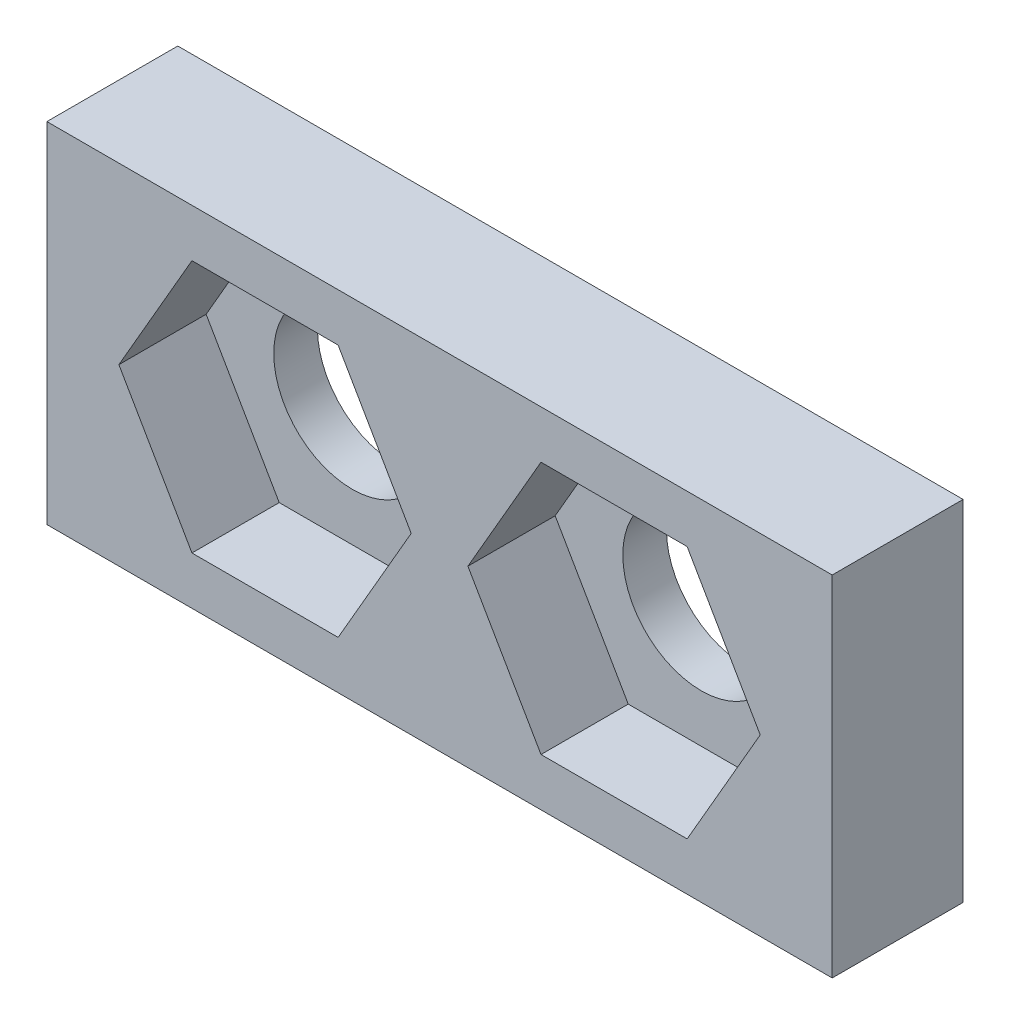
ISO-10303-21;
HEADER;
FILE_DESCRIPTION(('STEP AP214'),'2;1');
FILE_NAME('part.step','',(''),(''),'','','');
FILE_SCHEMA(('AUTOMOTIVE_DESIGN { 1 0 10303 214 1 1 1 1 }'));
ENDSEC;
DATA;
#1=APPLICATION_CONTEXT('core data for automotive mechanical design processes');
#2=APPLICATION_PROTOCOL_DEFINITION('international standard','automotive_design',2000,#1);
#3=PRODUCT_CONTEXT('',#1,'mechanical');
#4=PRODUCT('Part','Part','',(#3));
#5=PRODUCT_RELATED_PRODUCT_CATEGORY('part','',(#4));
#6=PRODUCT_DEFINITION_FORMATION('','',#4);
#7=PRODUCT_DEFINITION_CONTEXT('part definition',#1,'design');
#8=PRODUCT_DEFINITION('design','',#6,#7);
#9=PRODUCT_DEFINITION_SHAPE('','',#8);
#10=(LENGTH_UNIT() NAMED_UNIT(*) SI_UNIT(.MILLI.,.METRE.));
#11=(NAMED_UNIT(*) PLANE_ANGLE_UNIT() SI_UNIT($,.RADIAN.));
#12=(NAMED_UNIT(*) SI_UNIT($,.STERADIAN.) SOLID_ANGLE_UNIT());
#13=UNCERTAINTY_MEASURE_WITH_UNIT(LENGTH_MEASURE(1.E-05),#10,'distance_accuracy_value','');
#14=(GEOMETRIC_REPRESENTATION_CONTEXT(3) GLOBAL_UNCERTAINTY_ASSIGNED_CONTEXT((#13)) GLOBAL_UNIT_ASSIGNED_CONTEXT((#10,
#11,#12)) REPRESENTATION_CONTEXT('',''));
#15=CARTESIAN_POINT('',(0.,0.,0.));
#16=DIRECTION('',(0.,0.,1.));
#17=DIRECTION('',(1.,0.,0.));
#18=AXIS2_PLACEMENT_3D('',#15,#16,#17);
#19=CARTESIAN_POINT('',(9.,304.,3.));
#20=DIRECTION('',(1.,0.,0.));
#21=DIRECTION('',(0.,0.,-1.));
#22=AXIS2_PLACEMENT_3D('',#19,#20,#21);
#23=PLANE('',#22);
#24=DIRECTION('',(0.,-1.,0.));
#25=VECTOR('',#24,1.);
#26=CARTESIAN_POINT('',(9.,304.,0.));
#27=LINE('',#26,#25);
#28=CARTESIAN_POINT('',(9.,304.,0.));
#29=VERTEX_POINT('',#28);
#30=CARTESIAN_POINT('',(9.,296.,0.));
#31=VERTEX_POINT('',#30);
#32=EDGE_CURVE('E241',#29,#31,#27,.T.);
#33=ORIENTED_EDGE('',*,*,#32,.F.);
#34=DIRECTION('',(0.,0.,-1.));
#35=VECTOR('',#34,1.);
#36=CARTESIAN_POINT('',(9.,304.,3.));
#37=LINE('',#36,#35);
#38=CARTESIAN_POINT('',(9.,304.,3.));
#39=VERTEX_POINT('',#38);
#40=EDGE_CURVE('E11',#39,#29,#37,.T.);
#41=ORIENTED_EDGE('',*,*,#40,.F.);
#42=DIRECTION('',(0.,-1.,0.));
#43=VECTOR('',#42,1.);
#44=CARTESIAN_POINT('',(9.,304.,3.));
#45=LINE('',#44,#43);
#46=CARTESIAN_POINT('',(9.,296.,3.));
#47=VERTEX_POINT('',#46);
#48=EDGE_CURVE('E251',#39,#47,#45,.T.);
#49=ORIENTED_EDGE('',*,*,#48,.T.);
#50=DIRECTION('',(0.,0.,-1.));
#51=VECTOR('',#50,1.);
#52=CARTESIAN_POINT('',(9.,296.,3.));
#53=LINE('',#52,#51);
#54=EDGE_CURVE('E264',#47,#31,#53,.T.);
#55=ORIENTED_EDGE('',*,*,#54,.T.);
#56=EDGE_LOOP('',(#33,#41,#49,#55));
#57=FACE_BOUND('',#56,.T.);
#58=ADVANCED_FACE('F33',(#57),#23,.T.);
#59=CARTESIAN_POINT('',(-9.,304.,3.));
#60=DIRECTION('',(0.,1.,0.));
#61=DIRECTION('',(0.,0.,1.));
#62=AXIS2_PLACEMENT_3D('',#59,#60,#61);
#63=PLANE('',#62);
#64=DIRECTION('',(1.,0.,0.));
#65=VECTOR('',#64,1.);
#66=CARTESIAN_POINT('',(-9.,304.,0.));
#67=LINE('',#66,#65);
#68=CARTESIAN_POINT('',(-9.,304.,0.));
#69=VERTEX_POINT('',#68);
#70=EDGE_CURVE('E255',#69,#29,#67,.T.);
#71=ORIENTED_EDGE('',*,*,#70,.F.);
#72=DIRECTION('',(0.,0.,-1.));
#73=VECTOR('',#72,1.);
#74=CARTESIAN_POINT('',(-9.,304.,3.));
#75=LINE('',#74,#73);
#76=CARTESIAN_POINT('',(-9.,304.,3.));
#77=VERTEX_POINT('',#76);
#78=EDGE_CURVE('E41',#77,#69,#75,.T.);
#79=ORIENTED_EDGE('',*,*,#78,.F.);
#80=DIRECTION('',(1.,0.,0.));
#81=VECTOR('',#80,1.);
#82=CARTESIAN_POINT('',(-9.,304.,3.));
#83=LINE('',#82,#81);
#84=EDGE_CURVE('E261',#77,#39,#83,.T.);
#85=ORIENTED_EDGE('',*,*,#84,.T.);
#86=ORIENTED_EDGE('',*,*,#40,.T.);
#87=EDGE_LOOP('',(#71,#79,#85,#86));
#88=FACE_BOUND('',#87,.T.);
#89=ADVANCED_FACE('F313',(#88),#63,.T.);
#90=CARTESIAN_POINT('',(-9.,296.,3.));
#91=DIRECTION('',(-1.,0.,0.));
#92=DIRECTION('',(0.,0.,1.));
#93=AXIS2_PLACEMENT_3D('',#90,#91,#92);
#94=PLANE('',#93);
#95=DIRECTION('',(0.,1.,0.));
#96=VECTOR('',#95,1.);
#97=CARTESIAN_POINT('',(-9.,296.,0.));
#98=LINE('',#97,#96);
#99=CARTESIAN_POINT('',(-9.,296.,0.));
#100=VERTEX_POINT('',#99);
#101=EDGE_CURVE('E270',#100,#69,#98,.T.);
#102=ORIENTED_EDGE('',*,*,#101,.F.);
#103=DIRECTION('',(0.,0.,-1.));
#104=VECTOR('',#103,1.);
#105=CARTESIAN_POINT('',(-9.,296.,3.));
#106=LINE('',#105,#104);
#107=CARTESIAN_POINT('',(-9.,296.,3.));
#108=VERTEX_POINT('',#107);
#109=EDGE_CURVE('E276',#108,#100,#106,.T.);
#110=ORIENTED_EDGE('',*,*,#109,.F.);
#111=DIRECTION('',(0.,1.,0.));
#112=VECTOR('',#111,1.);
#113=CARTESIAN_POINT('',(-9.,296.,3.));
#114=LINE('',#113,#112);
#115=EDGE_CURVE('E258',#108,#77,#114,.T.);
#116=ORIENTED_EDGE('',*,*,#115,.T.);
#117=ORIENTED_EDGE('',*,*,#78,.T.);
#118=EDGE_LOOP('',(#102,#110,#116,#117));
#119=FACE_BOUND('',#118,.T.);
#120=ADVANCED_FACE('F311',(#119),#94,.T.);
#121=CARTESIAN_POINT('',(9.,296.,3.));
#122=DIRECTION('',(0.,-1.,0.));
#123=DIRECTION('',(0.,0.,-1.));
#124=AXIS2_PLACEMENT_3D('',#121,#122,#123);
#125=PLANE('',#124);
#126=DIRECTION('',(-1.,0.,0.));
#127=VECTOR('',#126,1.);
#128=CARTESIAN_POINT('',(9.,296.,0.));
#129=LINE('',#128,#127);
#130=EDGE_CURVE('E267',#31,#100,#129,.T.);
#131=ORIENTED_EDGE('',*,*,#130,.F.);
#132=ORIENTED_EDGE('',*,*,#54,.F.);
#133=DIRECTION('',(-1.,0.,0.));
#134=VECTOR('',#133,1.);
#135=CARTESIAN_POINT('',(9.,296.,3.));
#136=LINE('',#135,#134);
#137=EDGE_CURVE('E254',#47,#108,#136,.T.);
#138=ORIENTED_EDGE('',*,*,#137,.T.);
#139=ORIENTED_EDGE('',*,*,#109,.T.);
#140=EDGE_LOOP('',(#131,#132,#138,#139));
#141=FACE_BOUND('',#140,.T.);
#142=ADVANCED_FACE('F307',(#141),#125,.T.);
#143=CARTESIAN_POINT('',(0.,0.,3.));
#144=DIRECTION('',(0.,0.,-1.));
#145=DIRECTION('',(-1.,0.,0.));
#146=AXIS2_PLACEMENT_3D('',#143,#144,#145);
#147=PLANE('',#146);
#148=DIRECTION('',(0.49999999999996,0.866025403784462,0.));
#149=VECTOR('',#148,1.);
#150=CARTESIAN_POINT('',(5.6750000000001,297.098814897322,3.));
#151=LINE('',#150,#149);
#152=CARTESIAN_POINT('',(5.6750000000001,297.098814897322,3.));
#153=VERTEX_POINT('',#152);
#154=CARTESIAN_POINT('',(7.35,300.,3.));
#155=VERTEX_POINT('',#154);
#156=EDGE_CURVE('E184',#153,#155,#151,.T.);
#157=ORIENTED_EDGE('',*,*,#156,.F.);
#158=DIRECTION('',(1.,0.,0.));
#159=VECTOR('',#158,1.);
#160=CARTESIAN_POINT('',(2.32500000000013,297.098814897322,3.));
#161=LINE('',#160,#159);
#162=CARTESIAN_POINT('',(2.32500000000013,297.098814897322,3.));
#163=VERTEX_POINT('',#162);
#164=EDGE_CURVE('E49',#163,#153,#161,.T.);
#165=ORIENTED_EDGE('',*,*,#164,.F.);
#166=DIRECTION('',(0.500000000000004,-0.866025403784436,0.));
#167=VECTOR('',#166,1.);
#168=CARTESIAN_POINT('',(0.650000000000037,300.,3.));
#169=LINE('',#168,#167);
#170=CARTESIAN_POINT('',(0.650000000000037,300.,3.));
#171=VERTEX_POINT('',#170);
#172=EDGE_CURVE('E167',#171,#163,#169,.T.);
#173=ORIENTED_EDGE('',*,*,#172,.F.);
#174=DIRECTION('',(-0.499999999999954,-0.866025403784465,0.));
#175=VECTOR('',#174,1.);
#176=CARTESIAN_POINT('',(2.32499999999991,302.901185102678,3.));
#177=LINE('',#176,#175);
#178=CARTESIAN_POINT('',(2.32499999999991,302.901185102678,3.));
#179=VERTEX_POINT('',#178);
#180=EDGE_CURVE('E170',#179,#171,#177,.T.);
#181=ORIENTED_EDGE('',*,*,#180,.F.);
#182=DIRECTION('',(-1.,0.,0.));
#183=VECTOR('',#182,1.);
#184=CARTESIAN_POINT('',(5.675,302.901185102678,3.));
#185=LINE('',#184,#183);
#186=CARTESIAN_POINT('',(5.675,302.901185102678,3.));
#187=VERTEX_POINT('',#186);
#188=EDGE_CURVE('E190',#187,#179,#185,.T.);
#189=ORIENTED_EDGE('',*,*,#188,.F.);
#190=DIRECTION('',(-0.499999999999982,0.866025403784449,0.));
#191=VECTOR('',#190,1.);
#192=CARTESIAN_POINT('',(7.35,300.,3.));
#193=LINE('',#192,#191);
#194=EDGE_CURVE('E187',#155,#187,#193,.T.);
#195=ORIENTED_EDGE('',*,*,#194,.F.);
#196=EDGE_LOOP('',(#157,#165,#173,#181,#189,#195));
#197=FACE_BOUND('',#196,.T.);
#198=DIRECTION('',(-0.499999999999982,0.866025403784449,0.));
#199=VECTOR('',#198,1.);
#200=CARTESIAN_POINT('',(-0.65,300.,3.));
#201=LINE('',#200,#199);
#202=CARTESIAN_POINT('',(-0.650000000000067,300.,3.));
#203=VERTEX_POINT('',#202);
#204=CARTESIAN_POINT('',(-2.325,302.901185102678,3.));
#205=VERTEX_POINT('',#204);
#206=EDGE_CURVE('E225',#203,#205,#201,.T.);
#207=ORIENTED_EDGE('',*,*,#206,.F.);
#208=DIRECTION('',(0.499999999999968,0.866025403784457,0.));
#209=VECTOR('',#208,1.);
#210=CARTESIAN_POINT('',(-2.32499999999993,297.098814897322,3.));
#211=LINE('',#210,#209);
#212=CARTESIAN_POINT('',(-2.32499999999993,297.098814897322,3.));
#213=VERTEX_POINT('',#212);
#214=EDGE_CURVE('E57',#213,#203,#211,.T.);
#215=ORIENTED_EDGE('',*,*,#214,.F.);
#216=DIRECTION('',(1.,0.,0.));
#217=VECTOR('',#216,1.);
#218=CARTESIAN_POINT('',(-5.675,297.098814897322,3.));
#219=LINE('',#218,#217);
#220=CARTESIAN_POINT('',(-5.675,297.098814897322,3.));
#221=VERTEX_POINT('',#220);
#222=EDGE_CURVE('E208',#221,#213,#219,.T.);
#223=ORIENTED_EDGE('',*,*,#222,.F.);
#224=DIRECTION('',(0.499999999999982,-0.866025403784449,0.));
#225=VECTOR('',#224,1.);
#226=CARTESIAN_POINT('',(-7.35,300.,3.));
#227=LINE('',#226,#225);
#228=CARTESIAN_POINT('',(-7.35,300.,3.));
#229=VERTEX_POINT('',#228);
#230=EDGE_CURVE('E234',#229,#221,#227,.T.);
#231=ORIENTED_EDGE('',*,*,#230,.F.);
#232=DIRECTION('',(-0.500000000000013,-0.866025403784431,0.));
#233=VECTOR('',#232,1.);
#234=CARTESIAN_POINT('',(-5.67500000000015,302.901185102678,3.));
#235=LINE('',#234,#233);
#236=CARTESIAN_POINT('',(-5.67500000000015,302.901185102678,3.));
#237=VERTEX_POINT('',#236);
#238=EDGE_CURVE('E231',#237,#229,#235,.T.);
#239=ORIENTED_EDGE('',*,*,#238,.F.);
#240=DIRECTION('',(-1.,-1.49134436143671E-13,0.));
#241=VECTOR('',#240,1.);
#242=CARTESIAN_POINT('',(-2.325,302.901185102678,3.));
#243=LINE('',#242,#241);
#244=EDGE_CURVE('E228',#205,#237,#243,.T.);
#245=ORIENTED_EDGE('',*,*,#244,.F.);
#246=EDGE_LOOP('',(#207,#215,#223,#231,#239,#245));
#247=FACE_BOUND('',#246,.T.);
#248=ORIENTED_EDGE('',*,*,#48,.F.);
#249=ORIENTED_EDGE('',*,*,#84,.F.);
#250=ORIENTED_EDGE('',*,*,#115,.F.);
#251=ORIENTED_EDGE('',*,*,#137,.F.);
#252=EDGE_LOOP('',(#248,#249,#250,#251));
#253=FACE_BOUND('',#252,.T.);
#254=ADVANCED_FACE('F297',(#197,#247,#253),#147,.F.);
#255=CARTESIAN_POINT('',(0.,0.,0.));
#256=DIRECTION('',(0.,0.,-1.));
#257=DIRECTION('',(-1.,0.,0.));
#258=AXIS2_PLACEMENT_3D('',#255,#256,#257);
#259=PLANE('',#258);
#260=CARTESIAN_POINT('',(4.,300.,0.));
#261=DIRECTION('',(0.,0.,-1.));
#262=DIRECTION('',(-1.,0.,0.));
#263=AXIS2_PLACEMENT_3D('',#260,#261,#262);
#264=CIRCLE('',#263,1.79999999999999);
#265=CARTESIAN_POINT('',(2.20000000000001,300.,0.));
#266=VERTEX_POINT('',#265);
#267=EDGE_CURVE('E285',#266,#266,#264,.T.);
#268=ORIENTED_EDGE('',*,*,#267,.F.);
#269=EDGE_LOOP('',(#268));
#270=FACE_BOUND('',#269,.T.);
#271=CARTESIAN_POINT('',(-4.,300.,0.));
#272=DIRECTION('',(0.,0.,-1.));
#273=DIRECTION('',(-1.,0.,0.));
#274=AXIS2_PLACEMENT_3D('',#271,#272,#273);
#275=CIRCLE('',#274,1.79999999999999);
#276=CARTESIAN_POINT('',(-5.79999999999999,300.,0.));
#277=VERTEX_POINT('',#276);
#278=EDGE_CURVE('E173',#277,#277,#275,.T.);
#279=ORIENTED_EDGE('',*,*,#278,.F.);
#280=EDGE_LOOP('',(#279));
#281=FACE_BOUND('',#280,.T.);
#282=ORIENTED_EDGE('',*,*,#32,.T.);
#283=ORIENTED_EDGE('',*,*,#130,.T.);
#284=ORIENTED_EDGE('',*,*,#101,.T.);
#285=ORIENTED_EDGE('',*,*,#70,.T.);
#286=EDGE_LOOP('',(#282,#283,#284,#285));
#287=FACE_BOUND('',#286,.T.);
#288=ADVANCED_FACE('F293',(#270,#281,#287),#259,.T.);
#289=CARTESIAN_POINT('',(-2.32499999999993,297.098814897322,1.));
#290=DIRECTION('',(0.866025403784457,-0.499999999999968,0.));
#291=DIRECTION('',(0.499999999999968,0.866025403784457,0.));
#292=AXIS2_PLACEMENT_3D('',#289,#290,#291);
#293=PLANE('',#292);
#294=ORIENTED_EDGE('',*,*,#214,.T.);
#295=DIRECTION('',(0.,0.,1.));
#296=VECTOR('',#295,1.);
#297=CARTESIAN_POINT('',(-0.65,300.,1.));
#298=LINE('',#297,#296);
#299=CARTESIAN_POINT('',(-0.65,300.,1.));
#300=VERTEX_POINT('',#299);
#301=EDGE_CURVE('E223',#300,#203,#298,.T.);
#302=ORIENTED_EDGE('',*,*,#301,.F.);
#303=DIRECTION('',(0.499999999999968,0.866025403784457,0.));
#304=VECTOR('',#303,1.);
#305=CARTESIAN_POINT('',(-2.32499999999993,297.098814897322,1.));
#306=LINE('',#305,#304);
#307=CARTESIAN_POINT('',(-2.32499999999993,297.098814897322,1.));
#308=VERTEX_POINT('',#307);
#309=EDGE_CURVE('E204',#308,#300,#306,.T.);
#310=ORIENTED_EDGE('',*,*,#309,.F.);
#311=DIRECTION('',(0.,0.,1.));
#312=VECTOR('',#311,1.);
#313=CARTESIAN_POINT('',(-2.32499999999993,297.098814897322,1.));
#314=LINE('',#313,#312);
#315=EDGE_CURVE('E239',#308,#213,#314,.T.);
#316=ORIENTED_EDGE('',*,*,#315,.T.);
#317=EDGE_LOOP('',(#294,#302,#310,#316));
#318=FACE_BOUND('',#317,.T.);
#319=ADVANCED_FACE('F296',(#318),#293,.F.);
#320=CARTESIAN_POINT('',(-5.675,297.098814897322,1.));
#321=DIRECTION('',(0.,-1.,0.));
#322=DIRECTION('',(0.,0.,-1.));
#323=AXIS2_PLACEMENT_3D('',#320,#321,#322);
#324=PLANE('',#323);
#325=ORIENTED_EDGE('',*,*,#222,.T.);
#326=ORIENTED_EDGE('',*,*,#315,.F.);
#327=DIRECTION('',(1.,0.,0.));
#328=VECTOR('',#327,1.);
#329=CARTESIAN_POINT('',(-5.675,297.098814897322,1.));
#330=LINE('',#329,#328);
#331=CARTESIAN_POINT('',(-5.675,297.098814897322,1.));
#332=VERTEX_POINT('',#331);
#333=EDGE_CURVE('E220',#332,#308,#330,.T.);
#334=ORIENTED_EDGE('',*,*,#333,.F.);
#335=DIRECTION('',(0.,0.,1.));
#336=VECTOR('',#335,1.);
#337=CARTESIAN_POINT('',(-5.675,297.098814897322,1.));
#338=LINE('',#337,#336);
#339=EDGE_CURVE('E242',#332,#221,#338,.T.);
#340=ORIENTED_EDGE('',*,*,#339,.T.);
#341=EDGE_LOOP('',(#325,#326,#334,#340));
#342=FACE_BOUND('',#341,.T.);
#343=ADVANCED_FACE('F349',(#342),#324,.F.);
#344=CARTESIAN_POINT('',(-7.35,300.,1.));
#345=DIRECTION('',(-0.866025403784449,-0.499999999999982,0.));
#346=DIRECTION('',(0.499999999999982,-0.866025403784449,0.));
#347=AXIS2_PLACEMENT_3D('',#344,#345,#346);
#348=PLANE('',#347);
#349=ORIENTED_EDGE('',*,*,#230,.T.);
#350=ORIENTED_EDGE('',*,*,#339,.F.);
#351=DIRECTION('',(0.499999999999982,-0.866025403784449,0.));
#352=VECTOR('',#351,1.);
#353=CARTESIAN_POINT('',(-7.35,300.,1.));
#354=LINE('',#353,#352);
#355=CARTESIAN_POINT('',(-7.35,300.,1.));
#356=VERTEX_POINT('',#355);
#357=EDGE_CURVE('E217',#356,#332,#354,.T.);
#358=ORIENTED_EDGE('',*,*,#357,.F.);
#359=DIRECTION('',(0.,0.,1.));
#360=VECTOR('',#359,1.);
#361=CARTESIAN_POINT('',(-7.35,300.,1.));
#362=LINE('',#361,#360);
#363=EDGE_CURVE('E244',#356,#229,#362,.T.);
#364=ORIENTED_EDGE('',*,*,#363,.T.);
#365=EDGE_LOOP('',(#349,#350,#358,#364));
#366=FACE_BOUND('',#365,.T.);
#367=ADVANCED_FACE('F358',(#366),#348,.F.);
#368=CARTESIAN_POINT('',(-5.67500000000015,302.901185102678,1.));
#369=DIRECTION('',(-0.866025403784431,0.500000000000013,0.));
#370=DIRECTION('',(-0.500000000000013,-0.866025403784431,0.));
#371=AXIS2_PLACEMENT_3D('',#368,#369,#370);
#372=PLANE('',#371);
#373=ORIENTED_EDGE('',*,*,#238,.T.);
#374=ORIENTED_EDGE('',*,*,#363,.F.);
#375=DIRECTION('',(-0.500000000000013,-0.866025403784431,0.));
#376=VECTOR('',#375,1.);
#377=CARTESIAN_POINT('',(-5.67500000000015,302.901185102678,1.));
#378=LINE('',#377,#376);
#379=CARTESIAN_POINT('',(-5.67500000000015,302.901185102678,1.));
#380=VERTEX_POINT('',#379);
#381=EDGE_CURVE('E214',#380,#356,#378,.T.);
#382=ORIENTED_EDGE('',*,*,#381,.F.);
#383=DIRECTION('',(0.,0.,1.));
#384=VECTOR('',#383,1.);
#385=CARTESIAN_POINT('',(-5.67500000000015,302.901185102678,1.));
#386=LINE('',#385,#384);
#387=EDGE_CURVE('E246',#380,#237,#386,.T.);
#388=ORIENTED_EDGE('',*,*,#387,.T.);
#389=EDGE_LOOP('',(#373,#374,#382,#388));
#390=FACE_BOUND('',#389,.T.);
#391=ADVANCED_FACE('F368',(#390),#372,.F.);
#392=CARTESIAN_POINT('',(-2.325,302.901185102678,1.));
#393=DIRECTION('',(-1.49134436143671E-13,1.,0.));
#394=DIRECTION('',(-1.,-1.49134436143671E-13,0.));
#395=AXIS2_PLACEMENT_3D('',#392,#393,#394);
#396=PLANE('',#395);
#397=ORIENTED_EDGE('',*,*,#244,.T.);
#398=ORIENTED_EDGE('',*,*,#387,.F.);
#399=DIRECTION('',(-1.,-1.49134436143671E-13,0.));
#400=VECTOR('',#399,1.);
#401=CARTESIAN_POINT('',(-2.325,302.901185102678,1.));
#402=LINE('',#401,#400);
#403=CARTESIAN_POINT('',(-2.325,302.901185102678,1.));
#404=VERTEX_POINT('',#403);
#405=EDGE_CURVE('E211',#404,#380,#402,.T.);
#406=ORIENTED_EDGE('',*,*,#405,.F.);
#407=DIRECTION('',(0.,0.,1.));
#408=VECTOR('',#407,1.);
#409=CARTESIAN_POINT('',(-2.325,302.901185102678,1.));
#410=LINE('',#409,#408);
#411=EDGE_CURVE('E248',#404,#205,#410,.T.);
#412=ORIENTED_EDGE('',*,*,#411,.T.);
#413=EDGE_LOOP('',(#397,#398,#406,#412));
#414=FACE_BOUND('',#413,.T.);
#415=ADVANCED_FACE('F378',(#414),#396,.F.);
#416=CARTESIAN_POINT('',(-0.65,300.,1.));
#417=DIRECTION('',(0.866025403784449,0.499999999999982,0.));
#418=DIRECTION('',(-0.499999999999982,0.866025403784449,0.));
#419=AXIS2_PLACEMENT_3D('',#416,#417,#418);
#420=PLANE('',#419);
#421=ORIENTED_EDGE('',*,*,#206,.T.);
#422=ORIENTED_EDGE('',*,*,#411,.F.);
#423=DIRECTION('',(-0.499999999999982,0.866025403784449,0.));
#424=VECTOR('',#423,1.);
#425=CARTESIAN_POINT('',(-0.65,300.,1.));
#426=LINE('',#425,#424);
#427=EDGE_CURVE('E207',#300,#404,#426,.T.);
#428=ORIENTED_EDGE('',*,*,#427,.F.);
#429=ORIENTED_EDGE('',*,*,#301,.T.);
#430=EDGE_LOOP('',(#421,#422,#428,#429));
#431=FACE_BOUND('',#430,.T.);
#432=ADVANCED_FACE('F388',(#431),#420,.F.);
#433=CARTESIAN_POINT('',(0.,0.,1.));
#434=DIRECTION('',(0.,0.,1.));
#435=DIRECTION('',(1.,0.,0.));
#436=AXIS2_PLACEMENT_3D('',#433,#434,#435);
#437=PLANE('',#436);
#438=CARTESIAN_POINT('',(-4.,300.,1.));
#439=DIRECTION('',(0.,0.,1.));
#440=DIRECTION('',(1.,0.,0.));
#441=AXIS2_PLACEMENT_3D('',#438,#439,#440);
#442=CIRCLE('',#441,1.79999999999999);
#443=CARTESIAN_POINT('',(-2.20000000000001,300.,1.));
#444=VERTEX_POINT('',#443);
#445=EDGE_CURVE('E185',#444,#444,#442,.T.);
#446=ORIENTED_EDGE('',*,*,#445,.F.);
#447=EDGE_LOOP('',(#446));
#448=FACE_BOUND('',#447,.T.);
#449=ORIENTED_EDGE('',*,*,#309,.T.);
#450=ORIENTED_EDGE('',*,*,#427,.T.);
#451=ORIENTED_EDGE('',*,*,#405,.T.);
#452=ORIENTED_EDGE('',*,*,#381,.T.);
#453=ORIENTED_EDGE('',*,*,#357,.T.);
#454=ORIENTED_EDGE('',*,*,#333,.T.);
#455=EDGE_LOOP('',(#449,#450,#451,#452,#453,#454));
#456=FACE_BOUND('',#455,.T.);
#457=ADVANCED_FACE('F397',(#448,#456),#437,.T.);
#458=CARTESIAN_POINT('',(2.32500000000013,297.098814897322,1.));
#459=DIRECTION('',(0.,-1.,0.));
#460=DIRECTION('',(0.,0.,-1.));
#461=AXIS2_PLACEMENT_3D('',#458,#459,#460);
#462=PLANE('',#461);
#463=ORIENTED_EDGE('',*,*,#164,.T.);
#464=DIRECTION('',(0.,0.,1.));
#465=VECTOR('',#464,1.);
#466=CARTESIAN_POINT('',(5.6750000000001,297.098814897322,1.));
#467=LINE('',#466,#465);
#468=CARTESIAN_POINT('',(5.6750000000001,297.098814897322,1.));
#469=VERTEX_POINT('',#468);
#470=EDGE_CURVE('E144',#469,#153,#467,.T.);
#471=ORIENTED_EDGE('',*,*,#470,.F.);
#472=DIRECTION('',(1.,0.,0.));
#473=VECTOR('',#472,1.);
#474=CARTESIAN_POINT('',(2.32500000000013,297.098814897322,1.));
#475=LINE('',#474,#473);
#476=CARTESIAN_POINT('',(2.32500000000013,297.098814897322,1.));
#477=VERTEX_POINT('',#476);
#478=EDGE_CURVE('E148',#477,#469,#475,.T.);
#479=ORIENTED_EDGE('',*,*,#478,.F.);
#480=DIRECTION('',(0.,0.,1.));
#481=VECTOR('',#480,1.);
#482=CARTESIAN_POINT('',(2.32500000000013,297.098814897322,1.));
#483=LINE('',#482,#481);
#484=EDGE_CURVE('E195',#477,#163,#483,.T.);
#485=ORIENTED_EDGE('',*,*,#484,.T.);
#486=EDGE_LOOP('',(#463,#471,#479,#485));
#487=FACE_BOUND('',#486,.T.);
#488=ADVANCED_FACE('F146',(#487),#462,.F.);
#489=CARTESIAN_POINT('',(0.650000000000037,300.,1.));
#490=DIRECTION('',(-0.866025403784436,-0.500000000000004,0.));
#491=DIRECTION('',(0.500000000000004,-0.866025403784436,0.));
#492=AXIS2_PLACEMENT_3D('',#489,#490,#491);
#493=PLANE('',#492);
#494=ORIENTED_EDGE('',*,*,#172,.T.);
#495=ORIENTED_EDGE('',*,*,#484,.F.);
#496=DIRECTION('',(0.500000000000004,-0.866025403784436,0.));
#497=VECTOR('',#496,1.);
#498=CARTESIAN_POINT('',(0.650000000000037,300.,1.));
#499=LINE('',#498,#497);
#500=CARTESIAN_POINT('',(0.650000000000037,300.,1.));
#501=VERTEX_POINT('',#500);
#502=EDGE_CURVE('E154',#501,#477,#499,.T.);
#503=ORIENTED_EDGE('',*,*,#502,.F.);
#504=DIRECTION('',(0.,0.,1.));
#505=VECTOR('',#504,1.);
#506=CARTESIAN_POINT('',(0.650000000000037,300.,1.));
#507=LINE('',#506,#505);
#508=EDGE_CURVE('E197',#501,#171,#507,.T.);
#509=ORIENTED_EDGE('',*,*,#508,.T.);
#510=EDGE_LOOP('',(#494,#495,#503,#509));
#511=FACE_BOUND('',#510,.T.);
#512=ADVANCED_FACE('F413',(#511),#493,.F.);
#513=CARTESIAN_POINT('',(2.32499999999991,302.901185102678,1.));
#514=DIRECTION('',(-0.866025403784465,0.499999999999954,0.));
#515=DIRECTION('',(-0.499999999999954,-0.866025403784465,0.));
#516=AXIS2_PLACEMENT_3D('',#513,#514,#515);
#517=PLANE('',#516);
#518=ORIENTED_EDGE('',*,*,#180,.T.);
#519=ORIENTED_EDGE('',*,*,#508,.F.);
#520=DIRECTION('',(-0.499999999999954,-0.866025403784465,0.));
#521=VECTOR('',#520,1.);
#522=CARTESIAN_POINT('',(2.32499999999991,302.901185102678,1.));
#523=LINE('',#522,#521);
#524=CARTESIAN_POINT('',(2.32499999999991,302.901185102678,1.));
#525=VERTEX_POINT('',#524);
#526=EDGE_CURVE('E180',#525,#501,#523,.T.);
#527=ORIENTED_EDGE('',*,*,#526,.F.);
#528=DIRECTION('',(0.,0.,1.));
#529=VECTOR('',#528,1.);
#530=CARTESIAN_POINT('',(2.32499999999991,302.901185102678,1.));
#531=LINE('',#530,#529);
#532=EDGE_CURVE('E199',#525,#179,#531,.T.);
#533=ORIENTED_EDGE('',*,*,#532,.T.);
#534=EDGE_LOOP('',(#518,#519,#527,#533));
#535=FACE_BOUND('',#534,.T.);
#536=ADVANCED_FACE('F422',(#535),#517,.F.);
#537=CARTESIAN_POINT('',(5.675,302.901185102678,1.));
#538=DIRECTION('',(0.,1.,0.));
#539=DIRECTION('',(0.,0.,1.));
#540=AXIS2_PLACEMENT_3D('',#537,#538,#539);
#541=PLANE('',#540);
#542=ORIENTED_EDGE('',*,*,#188,.T.);
#543=ORIENTED_EDGE('',*,*,#532,.F.);
#544=DIRECTION('',(-1.,0.,0.));
#545=VECTOR('',#544,1.);
#546=CARTESIAN_POINT('',(5.675,302.901185102678,1.));
#547=LINE('',#546,#545);
#548=CARTESIAN_POINT('',(5.675,302.901185102678,1.));
#549=VERTEX_POINT('',#548);
#550=EDGE_CURVE('E177',#549,#525,#547,.T.);
#551=ORIENTED_EDGE('',*,*,#550,.F.);
#552=DIRECTION('',(0.,0.,1.));
#553=VECTOR('',#552,1.);
#554=CARTESIAN_POINT('',(5.675,302.901185102678,1.));
#555=LINE('',#554,#553);
#556=EDGE_CURVE('E201',#549,#187,#555,.T.);
#557=ORIENTED_EDGE('',*,*,#556,.T.);
#558=EDGE_LOOP('',(#542,#543,#551,#557));
#559=FACE_BOUND('',#558,.T.);
#560=ADVANCED_FACE('F432',(#559),#541,.F.);
#561=CARTESIAN_POINT('',(7.35,300.,1.));
#562=DIRECTION('',(0.866025403784449,0.499999999999982,0.));
#563=DIRECTION('',(-0.499999999999982,0.866025403784449,0.));
#564=AXIS2_PLACEMENT_3D('',#561,#562,#563);
#565=PLANE('',#564);
#566=ORIENTED_EDGE('',*,*,#194,.T.);
#567=ORIENTED_EDGE('',*,*,#556,.F.);
#568=DIRECTION('',(-0.499999999999982,0.866025403784449,0.));
#569=VECTOR('',#568,1.);
#570=CARTESIAN_POINT('',(7.35,300.,1.));
#571=LINE('',#570,#569);
#572=CARTESIAN_POINT('',(7.35,300.,1.));
#573=VERTEX_POINT('',#572);
#574=EDGE_CURVE('E162',#573,#549,#571,.T.);
#575=ORIENTED_EDGE('',*,*,#574,.F.);
#576=DIRECTION('',(0.,0.,1.));
#577=VECTOR('',#576,1.);
#578=CARTESIAN_POINT('',(7.35,300.,1.));
#579=LINE('',#578,#577);
#580=EDGE_CURVE('E153',#573,#155,#579,.T.);
#581=ORIENTED_EDGE('',*,*,#580,.T.);
#582=EDGE_LOOP('',(#566,#567,#575,#581));
#583=FACE_BOUND('',#582,.T.);
#584=ADVANCED_FACE('F442',(#583),#565,.F.);
#585=CARTESIAN_POINT('',(5.6750000000001,297.098814897322,1.));
#586=DIRECTION('',(0.866025403784462,-0.49999999999996,0.));
#587=DIRECTION('',(0.49999999999996,0.866025403784462,0.));
#588=AXIS2_PLACEMENT_3D('',#585,#586,#587);
#589=PLANE('',#588);
#590=ORIENTED_EDGE('',*,*,#156,.T.);
#591=ORIENTED_EDGE('',*,*,#580,.F.);
#592=DIRECTION('',(0.49999999999996,0.866025403784462,0.));
#593=VECTOR('',#592,1.);
#594=CARTESIAN_POINT('',(5.6750000000001,297.098814897322,1.));
#595=LINE('',#594,#593);
#596=EDGE_CURVE('E157',#469,#573,#595,.T.);
#597=ORIENTED_EDGE('',*,*,#596,.F.);
#598=ORIENTED_EDGE('',*,*,#470,.T.);
#599=EDGE_LOOP('',(#590,#591,#597,#598));
#600=FACE_BOUND('',#599,.T.);
#601=ADVANCED_FACE('F158',(#600),#589,.F.);
#602=CARTESIAN_POINT('',(0.,0.,1.));
#603=DIRECTION('',(0.,0.,1.));
#604=DIRECTION('',(1.,0.,0.));
#605=AXIS2_PLACEMENT_3D('',#602,#603,#604);
#606=PLANE('',#605);
#607=CARTESIAN_POINT('',(4.,300.,1.));
#608=DIRECTION('',(0.,0.,1.));
#609=DIRECTION('',(1.,0.,0.));
#610=AXIS2_PLACEMENT_3D('',#607,#608,#609);
#611=CIRCLE('',#610,1.79999999999999);
#612=CARTESIAN_POINT('',(5.79999999999999,300.,1.));
#613=VERTEX_POINT('',#612);
#614=EDGE_CURVE('E36',#613,#613,#611,.T.);
#615=ORIENTED_EDGE('',*,*,#614,.F.);
#616=EDGE_LOOP('',(#615));
#617=FACE_BOUND('',#616,.T.);
#618=ORIENTED_EDGE('',*,*,#478,.T.);
#619=ORIENTED_EDGE('',*,*,#596,.T.);
#620=ORIENTED_EDGE('',*,*,#574,.T.);
#621=ORIENTED_EDGE('',*,*,#550,.T.);
#622=ORIENTED_EDGE('',*,*,#526,.T.);
#623=ORIENTED_EDGE('',*,*,#502,.T.);
#624=EDGE_LOOP('',(#618,#619,#620,#621,#622,#623));
#625=FACE_BOUND('',#624,.T.);
#626=ADVANCED_FACE('F164',(#617,#625),#606,.T.);
#627=CARTESIAN_POINT('',(-4.,300.,0.));
#628=DIRECTION('',(0.,0.,-1.));
#629=DIRECTION('',(-1.,0.,0.));
#630=AXIS2_PLACEMENT_3D('',#627,#628,#629);
#631=CYLINDRICAL_SURFACE('',#630,1.79999999999999);
#632=ORIENTED_EDGE('',*,*,#445,.T.);
#633=EDGE_LOOP('',(#632));
#634=FACE_BOUND('',#633,.T.);
#635=ORIENTED_EDGE('',*,*,#278,.T.);
#636=EDGE_LOOP('',(#635));
#637=FACE_BOUND('',#636,.T.);
#638=ADVANCED_FACE('F481',(#634,#637),#631,.F.);
#639=CARTESIAN_POINT('',(4.,300.,0.));
#640=DIRECTION('',(0.,0.,-1.));
#641=DIRECTION('',(-1.,0.,0.));
#642=AXIS2_PLACEMENT_3D('',#639,#640,#641);
#643=CYLINDRICAL_SURFACE('',#642,1.79999999999999);
#644=ORIENTED_EDGE('',*,*,#614,.T.);
#645=EDGE_LOOP('',(#644));
#646=FACE_BOUND('',#645,.T.);
#647=ORIENTED_EDGE('',*,*,#267,.T.);
#648=EDGE_LOOP('',(#647));
#649=FACE_BOUND('',#648,.T.);
#650=ADVANCED_FACE('F291',(#646,#649),#643,.F.);
#651=CLOSED_SHELL('',(#58,#89,#120,#142,#254,#288,#319,#343,#367,#391,#415,#432,#457,#488,#512,
#536,#560,#584,#601,#626,#638,#650));
#652=MANIFOLD_SOLID_BREP('B2',#651);
#653=ADVANCED_BREP_SHAPE_REPRESENTATION('',(#18,#652),#14);
#654=SHAPE_DEFINITION_REPRESENTATION(#9,#653);
ENDSEC;
END-ISO-10303-21;
